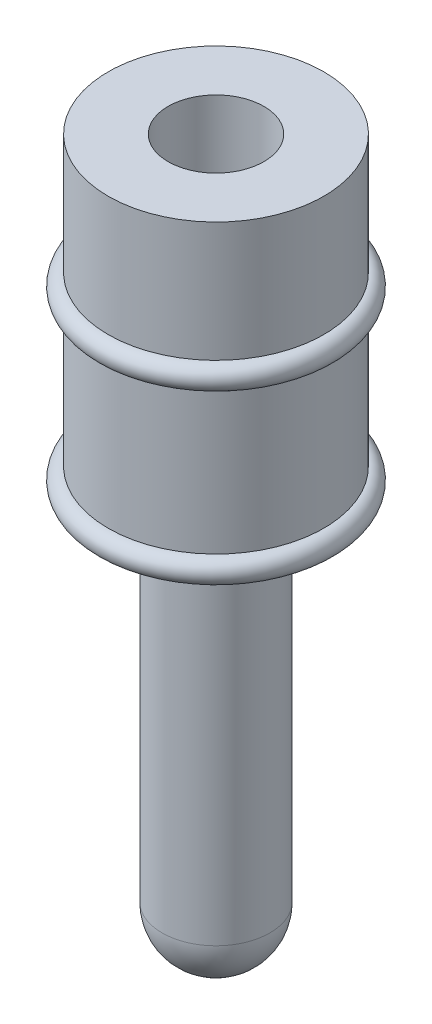
ISO-10303-21;
HEADER;
FILE_DESCRIPTION(('STEP AP214'),'2;1');
FILE_NAME('part.step','',(''),(''),'','','');
FILE_SCHEMA(('AUTOMOTIVE_DESIGN { 1 0 10303 214 1 1 1 1 }'));
ENDSEC;
DATA;
#1=APPLICATION_CONTEXT('core data for automotive mechanical design processes');
#2=APPLICATION_PROTOCOL_DEFINITION('international standard','automotive_design',2000,#1);
#3=PRODUCT_CONTEXT('',#1,'mechanical');
#4=PRODUCT('Part','Part','',(#3));
#5=PRODUCT_RELATED_PRODUCT_CATEGORY('part','',(#4));
#6=PRODUCT_DEFINITION_FORMATION('','',#4);
#7=PRODUCT_DEFINITION_CONTEXT('part definition',#1,'design');
#8=PRODUCT_DEFINITION('design','',#6,#7);
#9=PRODUCT_DEFINITION_SHAPE('','',#8);
#10=(LENGTH_UNIT() NAMED_UNIT(*) SI_UNIT(.MILLI.,.METRE.));
#11=(NAMED_UNIT(*) PLANE_ANGLE_UNIT() SI_UNIT($,.RADIAN.));
#12=(NAMED_UNIT(*) SI_UNIT($,.STERADIAN.) SOLID_ANGLE_UNIT());
#13=UNCERTAINTY_MEASURE_WITH_UNIT(LENGTH_MEASURE(1.E-05),#10,'distance_accuracy_value','');
#14=(GEOMETRIC_REPRESENTATION_CONTEXT(3) GLOBAL_UNCERTAINTY_ASSIGNED_CONTEXT((#13)) GLOBAL_UNIT_ASSIGNED_CONTEXT((#10,
#11,#12)) REPRESENTATION_CONTEXT('',''));
#15=CARTESIAN_POINT('',(0.,0.,0.));
#16=DIRECTION('',(0.,0.,1.));
#17=DIRECTION('',(1.,0.,0.));
#18=AXIS2_PLACEMENT_3D('',#15,#16,#17);
#19=CARTESIAN_POINT('',(0.,0.,0.));
#20=DIRECTION('',(0.,-1.,0.));
#21=DIRECTION('',(0.,0.,-1.));
#22=AXIS2_PLACEMENT_3D('',#19,#20,#21);
#23=CYLINDRICAL_SURFACE('',#22,2.25);
#24=CARTESIAN_POINT('',(0.,12.,0.));
#25=DIRECTION('',(0.,1.,0.));
#26=DIRECTION('',(0.,0.,1.));
#27=AXIS2_PLACEMENT_3D('',#24,#25,#26);
#28=CIRCLE('',#27,2.25);
#29=CARTESIAN_POINT('',(0.,12.,2.25));
#30=VERTEX_POINT('',#29);
#31=EDGE_CURVE('E40',#30,#30,#28,.T.);
#32=ORIENTED_EDGE('',*,*,#31,.F.);
#33=EDGE_LOOP('',(#32));
#34=FACE_BOUND('',#33,.T.);
#35=CARTESIAN_POINT('',(0.,9.,0.));
#36=DIRECTION('',(0.,-1.,0.));
#37=DIRECTION('',(0.,0.,-1.));
#38=AXIS2_PLACEMENT_3D('',#35,#36,#37);
#39=CIRCLE('',#38,2.25);
#40=CARTESIAN_POINT('',(0.,9.,-2.25));
#41=VERTEX_POINT('',#40);
#42=EDGE_CURVE('E10',#41,#41,#39,.T.);
#43=ORIENTED_EDGE('',*,*,#42,.F.);
#44=EDGE_LOOP('',(#43));
#45=FACE_BOUND('',#44,.T.);
#46=ADVANCED_FACE('F33',(#34,#45),#23,.T.);
#47=CARTESIAN_POINT('',(0.,15.,0.));
#48=DIRECTION('',(0.,-1.,0.));
#49=DIRECTION('',(0.,0.,-1.));
#50=AXIS2_PLACEMENT_3D('',#47,#48,#49);
#51=CIRCLE('',#50,2.25);
#52=CARTESIAN_POINT('',(0.,15.,-2.25));
#53=VERTEX_POINT('',#52);
#54=EDGE_CURVE('E48',#53,#53,#51,.T.);
#55=ORIENTED_EDGE('',*,*,#54,.T.);
#56=EDGE_LOOP('',(#55));
#57=FACE_BOUND('',#56,.T.);
#58=CARTESIAN_POINT('',(0.,12.5,0.));
#59=DIRECTION('',(0.,-1.,0.));
#60=DIRECTION('',(0.,0.,-1.));
#61=AXIS2_PLACEMENT_3D('',#58,#59,#60);
#62=CIRCLE('',#61,2.25);
#63=CARTESIAN_POINT('',(0.,12.5,-2.25));
#64=VERTEX_POINT('',#63);
#65=EDGE_CURVE('E44',#64,#64,#62,.T.);
#66=ORIENTED_EDGE('',*,*,#65,.F.);
#67=EDGE_LOOP('',(#66));
#68=FACE_BOUND('',#67,.T.);
#69=ADVANCED_FACE('F92',(#57,#68),#23,.T.);
#70=CARTESIAN_POINT('',(0.,15.,0.));
#71=DIRECTION('',(0.,-1.,0.));
#72=DIRECTION('',(0.,0.,-1.));
#73=AXIS2_PLACEMENT_3D('',#70,#71,#72);
#74=PLANE('',#73);
#75=CARTESIAN_POINT('',(0.,15.,0.));
#76=DIRECTION('',(0.,1.,0.));
#77=DIRECTION('',(-1.,0.,0.));
#78=AXIS2_PLACEMENT_3D('',#75,#76,#77);
#79=CIRCLE('',#78,1.);
#80=CARTESIAN_POINT('',(-1.,15.,0.));
#81=VERTEX_POINT('',#80);
#82=EDGE_CURVE('E68',#81,#81,#79,.T.);
#83=ORIENTED_EDGE('',*,*,#82,.F.);
#84=EDGE_LOOP('',(#83));
#85=FACE_BOUND('',#84,.T.);
#86=ORIENTED_EDGE('',*,*,#54,.F.);
#87=EDGE_LOOP('',(#86));
#88=FACE_BOUND('',#87,.T.);
#89=ADVANCED_FACE('F35',(#85,#88),#74,.F.);
#90=CARTESIAN_POINT('',(0.,11.,0.));
#91=DIRECTION('',(0.,-1.,0.));
#92=DIRECTION('',(1.,0.,0.));
#93=AXIS2_PLACEMENT_3D('',#90,#91,#92);
#94=PLANE('',#93);
#95=CARTESIAN_POINT('',(0.,11.,0.));
#96=DIRECTION('',(0.,1.,0.));
#97=DIRECTION('',(-1.,0.,0.));
#98=AXIS2_PLACEMENT_3D('',#95,#96,#97);
#99=CIRCLE('',#98,1.375);
#100=CARTESIAN_POINT('',(-1.375,11.,0.));
#101=VERTEX_POINT('',#100);
#102=EDGE_CURVE('E59',#101,#101,#99,.T.);
#103=ORIENTED_EDGE('',*,*,#102,.T.);
#104=EDGE_LOOP('',(#103));
#105=FACE_BOUND('',#104,.T.);
#106=ADVANCED_FACE('F106',(#105),#94,.F.);
#107=CARTESIAN_POINT('',(0.,15.,0.));
#108=DIRECTION('',(0.,1.,0.));
#109=DIRECTION('',(-1.,0.,0.));
#110=AXIS2_PLACEMENT_3D('',#107,#108,#109);
#111=CYLINDRICAL_SURFACE('',#110,1.375);
#112=ORIENTED_EDGE('',*,*,#102,.F.);
#113=EDGE_LOOP('',(#112));
#114=FACE_BOUND('',#113,.T.);
#115=CARTESIAN_POINT('',(0.,13.,0.));
#116=DIRECTION('',(0.,1.,0.));
#117=DIRECTION('',(-1.,0.,0.));
#118=AXIS2_PLACEMENT_3D('',#115,#116,#117);
#119=CIRCLE('',#118,1.375);
#120=CARTESIAN_POINT('',(-1.375,13.,0.));
#121=VERTEX_POINT('',#120);
#122=EDGE_CURVE('E62',#121,#121,#119,.T.);
#123=ORIENTED_EDGE('',*,*,#122,.T.);
#124=EDGE_LOOP('',(#123));
#125=FACE_BOUND('',#124,.T.);
#126=ADVANCED_FACE('F109',(#114,#125),#111,.F.);
#127=CARTESIAN_POINT('',(-1.375,13.,0.));
#128=DIRECTION('',(0.,1.,0.));
#129=DIRECTION('',(-1.,0.,0.));
#130=AXIS2_PLACEMENT_3D('',#127,#128,#129);
#131=PLANE('',#130);
#132=ORIENTED_EDGE('',*,*,#122,.F.);
#133=EDGE_LOOP('',(#132));
#134=FACE_BOUND('',#133,.T.);
#135=CARTESIAN_POINT('',(0.,13.,0.));
#136=DIRECTION('',(0.,1.,0.));
#137=DIRECTION('',(-1.,0.,0.));
#138=AXIS2_PLACEMENT_3D('',#135,#136,#137);
#139=CIRCLE('',#138,1.);
#140=CARTESIAN_POINT('',(-1.,13.,0.));
#141=VERTEX_POINT('',#140);
#142=EDGE_CURVE('E65',#141,#141,#139,.T.);
#143=ORIENTED_EDGE('',*,*,#142,.T.);
#144=EDGE_LOOP('',(#143));
#145=FACE_BOUND('',#144,.T.);
#146=ADVANCED_FACE('F113',(#134,#145),#131,.F.);
#147=CARTESIAN_POINT('',(0.,15.,0.));
#148=DIRECTION('',(0.,1.,0.));
#149=DIRECTION('',(-1.,0.,0.));
#150=AXIS2_PLACEMENT_3D('',#147,#148,#149);
#151=CYLINDRICAL_SURFACE('',#150,1.);
#152=ORIENTED_EDGE('',*,*,#142,.F.);
#153=EDGE_LOOP('',(#152));
#154=FACE_BOUND('',#153,.T.);
#155=ORIENTED_EDGE('',*,*,#82,.T.);
#156=EDGE_LOOP('',(#155));
#157=FACE_BOUND('',#156,.T.);
#158=ADVANCED_FACE('F89',(#154,#157),#151,.F.);
#159=CARTESIAN_POINT('',(0.,12.25,0.));
#160=DIRECTION('',(0.,-1.,0.));
#161=DIRECTION('',(0.,0.,-1.));
#162=AXIS2_PLACEMENT_3D('',#159,#160,#161);
#163=TOROIDAL_SURFACE('',#162,2.25,0.25);
#164=ORIENTED_EDGE('',*,*,#31,.T.);
#165=EDGE_LOOP('',(#164));
#166=FACE_BOUND('',#165,.T.);
#167=ORIENTED_EDGE('',*,*,#65,.T.);
#168=EDGE_LOOP('',(#167));
#169=FACE_BOUND('',#168,.T.);
#170=ADVANCED_FACE('F80',(#166,#169),#163,.T.);
#171=CARTESIAN_POINT('',(0.,8.75,0.));
#172=DIRECTION('',(0.,-1.,0.));
#173=DIRECTION('',(0.,0.,-1.));
#174=AXIS2_PLACEMENT_3D('',#171,#172,#173);
#175=TOROIDAL_SURFACE('',#174,2.25,0.25);
#176=CARTESIAN_POINT('',(0.,8.5,0.));
#177=DIRECTION('',(0.,-1.,0.));
#178=DIRECTION('',(0.,0.,-1.));
#179=AXIS2_PLACEMENT_3D('',#176,#177,#178);
#180=CIRCLE('',#179,2.25);
#181=CARTESIAN_POINT('',(0.,8.5,-2.25));
#182=VERTEX_POINT('',#181);
#183=EDGE_CURVE('E71',#182,#182,#180,.T.);
#184=ORIENTED_EDGE('',*,*,#183,.F.);
#185=EDGE_LOOP('',(#184));
#186=FACE_BOUND('',#185,.T.);
#187=ORIENTED_EDGE('',*,*,#42,.T.);
#188=EDGE_LOOP('',(#187));
#189=FACE_BOUND('',#188,.T.);
#190=ADVANCED_FACE('F77',(#186,#189),#175,.T.);
#191=CARTESIAN_POINT('',(0.,1.125,0.));
#192=DIRECTION('',(0.,-1.,0.));
#193=DIRECTION('',(-1.,0.,0.));
#194=AXIS2_PLACEMENT_3D('',#191,#192,#193);
#195=SPHERICAL_SURFACE('',#194,1.125);
#196=CARTESIAN_POINT('',(0.,1.125,0.));
#197=DIRECTION('',(0.,-1.,0.));
#198=DIRECTION('',(0.,0.,-1.));
#199=AXIS2_PLACEMENT_3D('',#196,#197,#198);
#200=CIRCLE('',#199,1.125);
#201=CARTESIAN_POINT('',(0.,1.125,-1.125));
#202=VERTEX_POINT('',#201);
#203=EDGE_CURVE('E56',#202,#202,#200,.T.);
#204=ORIENTED_EDGE('',*,*,#203,.T.);
#205=EDGE_LOOP('',(#204));
#206=FACE_BOUND('',#205,.T.);
#207=ADVANCED_FACE('F79',(#206),#195,.T.);
#208=CARTESIAN_POINT('',(0.,0.,0.));
#209=DIRECTION('',(0.,-1.,0.));
#210=DIRECTION('',(0.,0.,-1.));
#211=AXIS2_PLACEMENT_3D('',#208,#209,#210);
#212=CYLINDRICAL_SURFACE('',#211,1.125);
#213=ORIENTED_EDGE('',*,*,#203,.F.);
#214=EDGE_LOOP('',(#213));
#215=FACE_BOUND('',#214,.T.);
#216=CARTESIAN_POINT('',(0.,8.,0.));
#217=DIRECTION('',(0.,-1.,0.));
#218=DIRECTION('',(0.,0.,-1.));
#219=AXIS2_PLACEMENT_3D('',#216,#217,#218);
#220=CIRCLE('',#219,1.125);
#221=CARTESIAN_POINT('',(0.,8.,-1.125));
#222=VERTEX_POINT('',#221);
#223=EDGE_CURVE('E53',#222,#222,#220,.T.);
#224=ORIENTED_EDGE('',*,*,#223,.T.);
#225=EDGE_LOOP('',(#224));
#226=FACE_BOUND('',#225,.T.);
#227=ADVANCED_FACE('F86',(#215,#226),#212,.T.);
#228=CARTESIAN_POINT('',(0.,8.5,0.));
#229=DIRECTION('',(0.,1.,0.));
#230=DIRECTION('',(0.,0.,1.));
#231=AXIS2_PLACEMENT_3D('',#228,#229,#230);
#232=CONICAL_SURFACE('',#231,2.25,1.15257199721567);
#233=ORIENTED_EDGE('',*,*,#223,.F.);
#234=EDGE_LOOP('',(#233));
#235=FACE_BOUND('',#234,.T.);
#236=ORIENTED_EDGE('',*,*,#183,.T.);
#237=EDGE_LOOP('',(#236));
#238=FACE_BOUND('',#237,.T.);
#239=ADVANCED_FACE('F75',(#235,#238),#232,.T.);
#240=CLOSED_SHELL('',(#46,#69,#89,#106,#126,#146,#158,#170,#190,#207,#227,#239));
#241=MANIFOLD_SOLID_BREP('B2',#240);
#242=ADVANCED_BREP_SHAPE_REPRESENTATION('',(#18,#241),#14);
#243=SHAPE_DEFINITION_REPRESENTATION(#9,#242);
ENDSEC;
END-ISO-10303-21;
